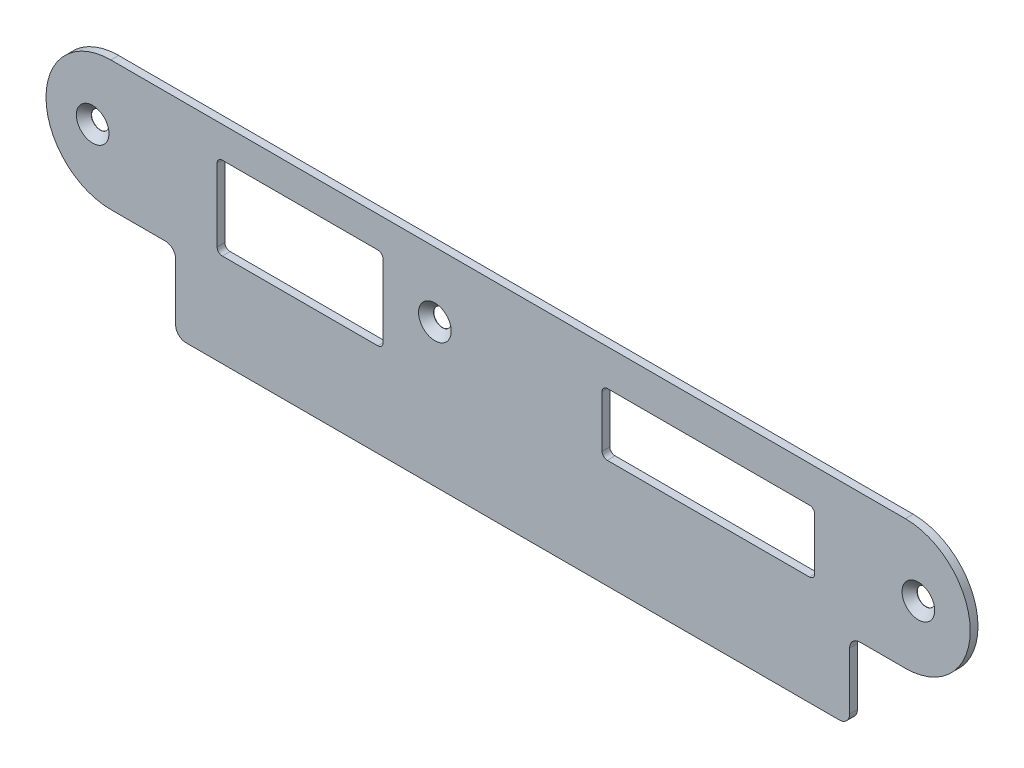
ISO-10303-21;
HEADER;
FILE_DESCRIPTION(('STEP AP214'),'2;1');
FILE_NAME('part.step','',(''),(''),'','','');
FILE_SCHEMA(('AUTOMOTIVE_DESIGN { 1 0 10303 214 1 1 1 1 }'));
ENDSEC;
DATA;
#1=APPLICATION_CONTEXT('core data for automotive mechanical design processes');
#2=APPLICATION_PROTOCOL_DEFINITION('international standard','automotive_design',2000,#1);
#3=PRODUCT_CONTEXT('',#1,'mechanical');
#4=PRODUCT('Part','Part','',(#3));
#5=PRODUCT_RELATED_PRODUCT_CATEGORY('part','',(#4));
#6=PRODUCT_DEFINITION_FORMATION('','',#4);
#7=PRODUCT_DEFINITION_CONTEXT('part definition',#1,'design');
#8=PRODUCT_DEFINITION('design','',#6,#7);
#9=PRODUCT_DEFINITION_SHAPE('','',#8);
#10=(LENGTH_UNIT() NAMED_UNIT(*) SI_UNIT(.MILLI.,.METRE.));
#11=(NAMED_UNIT(*) PLANE_ANGLE_UNIT() SI_UNIT($,.RADIAN.));
#12=(NAMED_UNIT(*) SI_UNIT($,.STERADIAN.) SOLID_ANGLE_UNIT());
#13=UNCERTAINTY_MEASURE_WITH_UNIT(LENGTH_MEASURE(1.E-05),#10,'distance_accuracy_value','');
#14=(GEOMETRIC_REPRESENTATION_CONTEXT(3) GLOBAL_UNCERTAINTY_ASSIGNED_CONTEXT((#13)) GLOBAL_UNIT_ASSIGNED_CONTEXT((#10,
#11,#12)) REPRESENTATION_CONTEXT('',''));
#15=CARTESIAN_POINT('',(0.,0.,0.));
#16=DIRECTION('',(0.,0.,1.));
#17=DIRECTION('',(1.,0.,0.));
#18=AXIS2_PLACEMENT_3D('',#15,#16,#17);
#19=CARTESIAN_POINT('',(-83.,6.50000000000004,1.5));
#20=DIRECTION('',(0.,0.,1.));
#21=DIRECTION('',(1.,0.,0.));
#22=AXIS2_PLACEMENT_3D('',#19,#20,#21);
#23=PLANE('',#22);
#24=CARTESIAN_POINT('',(-86.5,6.49999999999999,1.5));
#25=DIRECTION('',(0.,0.,1.));
#26=DIRECTION('',(1.,0.,0.));
#27=AXIS2_PLACEMENT_3D('',#24,#25,#26);
#28=CIRCLE('',#27,3.15);
#29=CARTESIAN_POINT('',(-83.35,6.49999999999999,1.5));
#30=VERTEX_POINT('',#29);
#31=EDGE_CURVE('E818',#30,#30,#28,.T.);
#32=ORIENTED_EDGE('',*,*,#31,.F.);
#33=EDGE_LOOP('',(#32));
#34=FACE_BOUND('',#33,.T.);
#35=CARTESIAN_POINT('',(-20.5,6.50000000000004,1.5));
#36=DIRECTION('',(0.,0.,1.));
#37=DIRECTION('',(1.,0.,0.));
#38=AXIS2_PLACEMENT_3D('',#35,#36,#37);
#39=CIRCLE('',#38,3.15);
#40=CARTESIAN_POINT('',(-17.35,6.50000000000004,1.5));
#41=VERTEX_POINT('',#40);
#42=EDGE_CURVE('E825',#41,#41,#39,.T.);
#43=ORIENTED_EDGE('',*,*,#42,.F.);
#44=EDGE_LOOP('',(#43));
#45=FACE_BOUND('',#44,.T.);
#46=CARTESIAN_POINT('',(72.75,6.50000000000006,1.5));
#47=DIRECTION('',(0.,0.,1.));
#48=DIRECTION('',(1.,0.,0.));
#49=AXIS2_PLACEMENT_3D('',#46,#47,#48);
#50=CIRCLE('',#49,3.15);
#51=CARTESIAN_POINT('',(75.9,6.50000000000006,1.5));
#52=VERTEX_POINT('',#51);
#53=EDGE_CURVE('E834',#52,#52,#50,.T.);
#54=ORIENTED_EDGE('',*,*,#53,.F.);
#55=EDGE_LOOP('',(#54));
#56=FACE_BOUND('',#55,.T.);
#57=DIRECTION('',(-1.,0.,0.));
#58=VECTOR('',#57,1.);
#59=CARTESIAN_POINT('',(51.75,12.0000000000001,1.5));
#60=LINE('',#59,#58);
#61=CARTESIAN_POINT('',(51.75,12.0000000000001,1.5));
#62=VERTEX_POINT('',#61);
#63=CARTESIAN_POINT('',(12.75,12.,1.5));
#64=VERTEX_POINT('',#63);
#65=EDGE_CURVE('E226',#62,#64,#60,.T.);
#66=ORIENTED_EDGE('',*,*,#65,.F.);
#67=CARTESIAN_POINT('',(51.75,11.,1.5));
#68=DIRECTION('',(0.,0.,1.));
#69=DIRECTION('',(1.,0.,0.));
#70=AXIS2_PLACEMENT_3D('',#67,#68,#69);
#71=CIRCLE('',#70,1.00000000000002);
#72=CARTESIAN_POINT('',(52.75,11.,1.5));
#73=VERTEX_POINT('',#72);
#74=EDGE_CURVE('E218',#73,#62,#71,.T.);
#75=ORIENTED_EDGE('',*,*,#74,.F.);
#76=DIRECTION('',(0.,1.,0.));
#77=VECTOR('',#76,1.);
#78=CARTESIAN_POINT('',(52.75,1.00000000000005,1.5));
#79=LINE('',#78,#77);
#80=CARTESIAN_POINT('',(52.75,1.00000000000005,1.5));
#81=VERTEX_POINT('',#80);
#82=EDGE_CURVE('E253',#81,#73,#79,.T.);
#83=ORIENTED_EDGE('',*,*,#82,.F.);
#84=CARTESIAN_POINT('',(51.75,1.00000000000004,1.5));
#85=DIRECTION('',(0.,0.,1.));
#86=DIRECTION('',(1.,0.,0.));
#87=AXIS2_PLACEMENT_3D('',#84,#85,#86);
#88=CIRCLE('',#87,0.999999999999997);
#89=CARTESIAN_POINT('',(51.75,0.,1.5));
#90=VERTEX_POINT('',#89);
#91=EDGE_CURVE('E251',#90,#81,#88,.T.);
#92=ORIENTED_EDGE('',*,*,#91,.F.);
#93=DIRECTION('',(1.,0.,0.));
#94=VECTOR('',#93,1.);
#95=CARTESIAN_POINT('',(12.75,0.,1.5));
#96=LINE('',#95,#94);
#97=CARTESIAN_POINT('',(12.75,0.,1.5));
#98=VERTEX_POINT('',#97);
#99=EDGE_CURVE('E249',#98,#90,#96,.T.);
#100=ORIENTED_EDGE('',*,*,#99,.F.);
#101=CARTESIAN_POINT('',(12.75,1.00000000000004,1.5));
#102=DIRECTION('',(0.,0.,1.));
#103=DIRECTION('',(1.,0.,0.));
#104=AXIS2_PLACEMENT_3D('',#101,#102,#103);
#105=CIRCLE('',#104,0.999999999999999);
#106=CARTESIAN_POINT('',(11.75,1.00000000000004,1.5));
#107=VERTEX_POINT('',#106);
#108=EDGE_CURVE('E247',#107,#98,#105,.T.);
#109=ORIENTED_EDGE('',*,*,#108,.F.);
#110=DIRECTION('',(0.,-1.,0.));
#111=VECTOR('',#110,1.);
#112=CARTESIAN_POINT('',(11.75,11.,1.5));
#113=LINE('',#112,#111);
#114=CARTESIAN_POINT('',(11.75,11.,1.5));
#115=VERTEX_POINT('',#114);
#116=EDGE_CURVE('E242',#115,#107,#113,.T.);
#117=ORIENTED_EDGE('',*,*,#116,.F.);
#118=CARTESIAN_POINT('',(12.75,11.,1.5));
#119=DIRECTION('',(0.,0.,1.));
#120=DIRECTION('',(1.,0.,0.));
#121=AXIS2_PLACEMENT_3D('',#118,#119,#120);
#122=CIRCLE('',#121,1.);
#123=EDGE_CURVE('E240',#64,#115,#122,.T.);
#124=ORIENTED_EDGE('',*,*,#123,.F.);
#125=EDGE_LOOP('',(#66,#75,#83,#92,#100,#109,#117,#124));
#126=FACE_BOUND('',#125,.T.);
#127=DIRECTION('',(0.,-1.,0.));
#128=VECTOR('',#127,1.);
#129=CARTESIAN_POINT('',(-62.5,12.,1.5));
#130=LINE('',#129,#128);
#131=CARTESIAN_POINT('',(-62.5,12.,1.5));
#132=VERTEX_POINT('',#131);
#133=CARTESIAN_POINT('',(-62.5,-2.00000000000002,1.5));
#134=VERTEX_POINT('',#133);
#135=EDGE_CURVE('E288',#132,#134,#130,.T.);
#136=ORIENTED_EDGE('',*,*,#135,.F.);
#137=CARTESIAN_POINT('',(-61.5,12.,1.5));
#138=DIRECTION('',(0.,0.,1.));
#139=DIRECTION('',(1.,0.,0.));
#140=AXIS2_PLACEMENT_3D('',#137,#138,#139);
#141=CIRCLE('',#140,1.);
#142=CARTESIAN_POINT('',(-61.5,13.,1.5));
#143=VERTEX_POINT('',#142);
#144=EDGE_CURVE('E286',#143,#132,#141,.T.);
#145=ORIENTED_EDGE('',*,*,#144,.F.);
#146=DIRECTION('',(-1.,0.,0.));
#147=VECTOR('',#146,1.);
#148=CARTESIAN_POINT('',(-31.5,13.,1.5));
#149=LINE('',#148,#147);
#150=CARTESIAN_POINT('',(-31.5,13.,1.5));
#151=VERTEX_POINT('',#150);
#152=EDGE_CURVE('E302',#151,#143,#149,.T.);
#153=ORIENTED_EDGE('',*,*,#152,.F.);
#154=CARTESIAN_POINT('',(-31.5,12.,1.5));
#155=DIRECTION('',(0.,0.,1.));
#156=DIRECTION('',(1.,0.,0.));
#157=AXIS2_PLACEMENT_3D('',#154,#155,#156);
#158=CIRCLE('',#157,0.999999999999991);
#159=CARTESIAN_POINT('',(-30.5,12.,1.5));
#160=VERTEX_POINT('',#159);
#161=EDGE_CURVE('E299',#160,#151,#158,.T.);
#162=ORIENTED_EDGE('',*,*,#161,.F.);
#163=DIRECTION('',(0.,1.,0.));
#164=VECTOR('',#163,1.);
#165=CARTESIAN_POINT('',(-30.5,-2.00000000000002,1.5));
#166=LINE('',#165,#164);
#167=CARTESIAN_POINT('',(-30.5,-2.00000000000002,1.5));
#168=VERTEX_POINT('',#167);
#169=EDGE_CURVE('E297',#168,#160,#166,.T.);
#170=ORIENTED_EDGE('',*,*,#169,.F.);
#171=CARTESIAN_POINT('',(-31.5,-2.00000000000002,1.5));
#172=DIRECTION('',(0.,0.,1.));
#173=DIRECTION('',(1.,0.,0.));
#174=AXIS2_PLACEMENT_3D('',#171,#172,#173);
#175=CIRCLE('',#174,1.);
#176=CARTESIAN_POINT('',(-31.5,-3.00000000000002,1.5));
#177=VERTEX_POINT('',#176);
#178=EDGE_CURVE('E295',#177,#168,#175,.T.);
#179=ORIENTED_EDGE('',*,*,#178,.F.);
#180=DIRECTION('',(1.,0.,0.));
#181=VECTOR('',#180,1.);
#182=CARTESIAN_POINT('',(-61.5,-3.00000000000003,1.5));
#183=LINE('',#182,#181);
#184=CARTESIAN_POINT('',(-61.5,-3.00000000000003,1.5));
#185=VERTEX_POINT('',#184);
#186=EDGE_CURVE('E293',#185,#177,#183,.T.);
#187=ORIENTED_EDGE('',*,*,#186,.F.);
#188=CARTESIAN_POINT('',(-61.5,-2.00000000000003,1.5));
#189=DIRECTION('',(0.,0.,1.));
#190=DIRECTION('',(1.,0.,0.));
#191=AXIS2_PLACEMENT_3D('',#188,#189,#190);
#192=CIRCLE('',#191,1.);
#193=EDGE_CURVE('E291',#134,#185,#192,.T.);
#194=ORIENTED_EDGE('',*,*,#193,.F.);
#195=EDGE_LOOP('',(#136,#145,#153,#162,#170,#179,#187,#194));
#196=FACE_BOUND('',#195,.T.);
#197=CARTESIAN_POINT('',(-83.,6.50000000000004,1.5));
#198=DIRECTION('',(0.,0.,1.));
#199=DIRECTION('',(1.,0.,0.));
#200=AXIS2_PLACEMENT_3D('',#197,#198,#199);
#201=CIRCLE('',#200,12.5);
#202=CARTESIAN_POINT('',(-83.,19.,1.5));
#203=VERTEX_POINT('',#202);
#204=CARTESIAN_POINT('',(-83.,-5.99999999999994,1.5));
#205=VERTEX_POINT('',#204);
#206=EDGE_CURVE('E345',#203,#205,#201,.T.);
#207=ORIENTED_EDGE('',*,*,#206,.T.);
#208=DIRECTION('',(1.,0.,0.));
#209=VECTOR('',#208,1.);
#210=CARTESIAN_POINT('',(-83.,-5.99999999999994,1.5));
#211=LINE('',#210,#209);
#212=CARTESIAN_POINT('',(-72.5,-6.00000000000005,1.5));
#213=VERTEX_POINT('',#212);
#214=EDGE_CURVE('E348',#205,#213,#211,.T.);
#215=ORIENTED_EDGE('',*,*,#214,.T.);
#216=CARTESIAN_POINT('',(-72.5,-8.00000000000005,1.5));
#217=DIRECTION('',(0.,0.,-1.));
#218=DIRECTION('',(1.,0.,0.));
#219=AXIS2_PLACEMENT_3D('',#216,#217,#218);
#220=CIRCLE('',#219,2.);
#221=CARTESIAN_POINT('',(-70.5,-8.00000000000005,1.5));
#222=VERTEX_POINT('',#221);
#223=EDGE_CURVE('E351',#213,#222,#220,.T.);
#224=ORIENTED_EDGE('',*,*,#223,.T.);
#225=DIRECTION('',(0.,-1.,0.));
#226=VECTOR('',#225,1.);
#227=CARTESIAN_POINT('',(-70.5,-8.00000000000005,1.5));
#228=LINE('',#227,#226);
#229=CARTESIAN_POINT('',(-70.5,-19.,1.5));
#230=VERTEX_POINT('',#229);
#231=EDGE_CURVE('E353',#222,#230,#228,.T.);
#232=ORIENTED_EDGE('',*,*,#231,.T.);
#233=CARTESIAN_POINT('',(-68.5,-19.,1.5));
#234=DIRECTION('',(0.,0.,1.));
#235=DIRECTION('',(1.,0.,0.));
#236=AXIS2_PLACEMENT_3D('',#233,#234,#235);
#237=CIRCLE('',#236,2.00000000000001);
#238=CARTESIAN_POINT('',(-68.5,-21.,1.5));
#239=VERTEX_POINT('',#238);
#240=EDGE_CURVE('E355',#230,#239,#237,.T.);
#241=ORIENTED_EDGE('',*,*,#240,.T.);
#242=DIRECTION('',(1.,0.,0.));
#243=VECTOR('',#242,1.);
#244=CARTESIAN_POINT('',(-68.5,-21.,1.5));
#245=LINE('',#244,#243);
#246=CARTESIAN_POINT('',(57.5,-20.9999999999999,1.5));
#247=VERTEX_POINT('',#246);
#248=EDGE_CURVE('E357',#239,#247,#245,.T.);
#249=ORIENTED_EDGE('',*,*,#248,.T.);
#250=CARTESIAN_POINT('',(57.5,-18.9999999999999,1.5));
#251=DIRECTION('',(0.,0.,1.));
#252=DIRECTION('',(1.,0.,0.));
#253=AXIS2_PLACEMENT_3D('',#250,#251,#252);
#254=CIRCLE('',#253,1.99999999999999);
#255=CARTESIAN_POINT('',(59.5,-18.9999999999999,1.5));
#256=VERTEX_POINT('',#255);
#257=EDGE_CURVE('E359',#247,#256,#254,.T.);
#258=ORIENTED_EDGE('',*,*,#257,.T.);
#259=DIRECTION('',(0.,1.,0.));
#260=VECTOR('',#259,1.);
#261=CARTESIAN_POINT('',(59.5,-18.9999999999999,1.5));
#262=LINE('',#261,#260);
#263=CARTESIAN_POINT('',(59.5,-7.99999999999995,1.5));
#264=VERTEX_POINT('',#263);
#265=EDGE_CURVE('E361',#256,#264,#262,.T.);
#266=ORIENTED_EDGE('',*,*,#265,.T.);
#267=CARTESIAN_POINT('',(61.5,-7.99999999999995,1.5));
#268=DIRECTION('',(0.,0.,-1.));
#269=DIRECTION('',(1.,0.,0.));
#270=AXIS2_PLACEMENT_3D('',#267,#268,#269);
#271=CIRCLE('',#270,2.);
#272=CARTESIAN_POINT('',(61.5,-5.99999999999995,1.5));
#273=VERTEX_POINT('',#272);
#274=EDGE_CURVE('E363',#264,#273,#271,.T.);
#275=ORIENTED_EDGE('',*,*,#274,.T.);
#276=DIRECTION('',(1.,0.,0.));
#277=VECTOR('',#276,1.);
#278=CARTESIAN_POINT('',(61.5,-5.99999999999995,1.5));
#279=LINE('',#278,#277);
#280=CARTESIAN_POINT('',(70.25,-5.99999999999994,1.5));
#281=VERTEX_POINT('',#280);
#282=EDGE_CURVE('E365',#273,#281,#279,.T.);
#283=ORIENTED_EDGE('',*,*,#282,.T.);
#284=CARTESIAN_POINT('',(70.25,6.50000000000006,1.5));
#285=DIRECTION('',(0.,0.,1.));
#286=DIRECTION('',(1.,0.,0.));
#287=AXIS2_PLACEMENT_3D('',#284,#285,#286);
#288=CIRCLE('',#287,12.5);
#289=CARTESIAN_POINT('',(70.25,19.0000000000001,1.5));
#290=VERTEX_POINT('',#289);
#291=EDGE_CURVE('E367',#281,#290,#288,.T.);
#292=ORIENTED_EDGE('',*,*,#291,.T.);
#293=DIRECTION('',(-1.,0.,0.));
#294=VECTOR('',#293,1.);
#295=CARTESIAN_POINT('',(70.25,19.0000000000001,1.5));
#296=LINE('',#295,#294);
#297=EDGE_CURVE('E369',#290,#203,#296,.T.);
#298=ORIENTED_EDGE('',*,*,#297,.T.);
#299=EDGE_LOOP('',(#207,#215,#224,#232,#241,#249,#258,#266,#275,#283,#292,#298));
#300=FACE_BOUND('',#299,.T.);
#301=ADVANCED_FACE('F33',(#34,#45,#56,#126,#196,#300),#23,.T.);
#302=CARTESIAN_POINT('',(-83.,6.50000000000004,0.));
#303=DIRECTION('',(0.,0.,1.));
#304=DIRECTION('',(1.,0.,0.));
#305=AXIS2_PLACEMENT_3D('',#302,#303,#304);
#306=PLANE('',#305);
#307=CARTESIAN_POINT('',(-86.5,6.49999999999999,0.));
#308=DIRECTION('',(0.,0.,1.));
#309=DIRECTION('',(1.,0.,0.));
#310=AXIS2_PLACEMENT_3D('',#307,#308,#309);
#311=CIRCLE('',#310,1.69999999999999);
#312=CARTESIAN_POINT('',(-84.8,6.49999999999999,0.));
#313=VERTEX_POINT('',#312);
#314=EDGE_CURVE('E820',#313,#313,#311,.T.);
#315=ORIENTED_EDGE('',*,*,#314,.T.);
#316=EDGE_LOOP('',(#315));
#317=FACE_BOUND('',#316,.T.);
#318=CARTESIAN_POINT('',(-20.5,6.50000000000004,0.));
#319=DIRECTION('',(0.,0.,1.));
#320=DIRECTION('',(1.,0.,0.));
#321=AXIS2_PLACEMENT_3D('',#318,#319,#320);
#322=CIRCLE('',#321,1.7);
#323=CARTESIAN_POINT('',(-18.8,6.50000000000004,0.));
#324=VERTEX_POINT('',#323);
#325=EDGE_CURVE('E831',#324,#324,#322,.T.);
#326=ORIENTED_EDGE('',*,*,#325,.T.);
#327=EDGE_LOOP('',(#326));
#328=FACE_BOUND('',#327,.T.);
#329=CARTESIAN_POINT('',(72.75,6.50000000000006,0.));
#330=DIRECTION('',(0.,0.,1.));
#331=DIRECTION('',(1.,0.,0.));
#332=AXIS2_PLACEMENT_3D('',#329,#330,#331);
#333=CIRCLE('',#332,1.69999999999999);
#334=CARTESIAN_POINT('',(74.45,6.50000000000006,0.));
#335=VERTEX_POINT('',#334);
#336=EDGE_CURVE('E256',#335,#335,#333,.T.);
#337=ORIENTED_EDGE('',*,*,#336,.T.);
#338=EDGE_LOOP('',(#337));
#339=FACE_BOUND('',#338,.T.);
#340=CARTESIAN_POINT('',(51.75,11.,0.));
#341=DIRECTION('',(0.,0.,1.));
#342=DIRECTION('',(1.,0.,0.));
#343=AXIS2_PLACEMENT_3D('',#340,#341,#342);
#344=CIRCLE('',#343,1.00000000000002);
#345=CARTESIAN_POINT('',(52.75,11.,0.));
#346=VERTEX_POINT('',#345);
#347=CARTESIAN_POINT('',(51.75,12.0000000000001,0.));
#348=VERTEX_POINT('',#347);
#349=EDGE_CURVE('E56',#346,#348,#344,.T.);
#350=ORIENTED_EDGE('',*,*,#349,.T.);
#351=DIRECTION('',(-1.,0.,0.));
#352=VECTOR('',#351,1.);
#353=CARTESIAN_POINT('',(51.75,12.0000000000001,0.));
#354=LINE('',#353,#352);
#355=CARTESIAN_POINT('',(12.75,12.,0.));
#356=VERTEX_POINT('',#355);
#357=EDGE_CURVE('E233',#348,#356,#354,.T.);
#358=ORIENTED_EDGE('',*,*,#357,.T.);
#359=CARTESIAN_POINT('',(12.75,11.,0.));
#360=DIRECTION('',(0.,0.,1.));
#361=DIRECTION('',(1.,0.,0.));
#362=AXIS2_PLACEMENT_3D('',#359,#360,#361);
#363=CIRCLE('',#362,1.);
#364=CARTESIAN_POINT('',(11.75,11.,0.));
#365=VERTEX_POINT('',#364);
#366=EDGE_CURVE('E258',#356,#365,#363,.T.);
#367=ORIENTED_EDGE('',*,*,#366,.T.);
#368=DIRECTION('',(0.,-1.,0.));
#369=VECTOR('',#368,1.);
#370=CARTESIAN_POINT('',(11.75,11.,0.));
#371=LINE('',#370,#369);
#372=CARTESIAN_POINT('',(11.75,1.00000000000004,0.));
#373=VERTEX_POINT('',#372);
#374=EDGE_CURVE('E261',#365,#373,#371,.T.);
#375=ORIENTED_EDGE('',*,*,#374,.T.);
#376=CARTESIAN_POINT('',(12.75,1.00000000000004,0.));
#377=DIRECTION('',(0.,0.,1.));
#378=DIRECTION('',(1.,0.,0.));
#379=AXIS2_PLACEMENT_3D('',#376,#377,#378);
#380=CIRCLE('',#379,0.999999999999999);
#381=CARTESIAN_POINT('',(12.75,0.,0.));
#382=VERTEX_POINT('',#381);
#383=EDGE_CURVE('E264',#373,#382,#380,.T.);
#384=ORIENTED_EDGE('',*,*,#383,.T.);
#385=DIRECTION('',(1.,0.,0.));
#386=VECTOR('',#385,1.);
#387=CARTESIAN_POINT('',(12.75,0.,0.));
#388=LINE('',#387,#386);
#389=CARTESIAN_POINT('',(51.75,0.,0.));
#390=VERTEX_POINT('',#389);
#391=EDGE_CURVE('E267',#382,#390,#388,.T.);
#392=ORIENTED_EDGE('',*,*,#391,.T.);
#393=CARTESIAN_POINT('',(51.75,1.00000000000004,0.));
#394=DIRECTION('',(0.,0.,1.));
#395=DIRECTION('',(1.,0.,0.));
#396=AXIS2_PLACEMENT_3D('',#393,#394,#395);
#397=CIRCLE('',#396,0.999999999999997);
#398=CARTESIAN_POINT('',(52.75,1.00000000000005,0.));
#399=VERTEX_POINT('',#398);
#400=EDGE_CURVE('E270',#390,#399,#397,.T.);
#401=ORIENTED_EDGE('',*,*,#400,.T.);
#402=DIRECTION('',(0.,1.,0.));
#403=VECTOR('',#402,1.);
#404=CARTESIAN_POINT('',(52.75,1.00000000000005,0.));
#405=LINE('',#404,#403);
#406=EDGE_CURVE('E227',#399,#346,#405,.T.);
#407=ORIENTED_EDGE('',*,*,#406,.T.);
#408=EDGE_LOOP('',(#350,#358,#367,#375,#384,#392,#401,#407));
#409=FACE_BOUND('',#408,.T.);
#410=CARTESIAN_POINT('',(-61.5,12.,0.));
#411=DIRECTION('',(0.,0.,1.));
#412=DIRECTION('',(1.,0.,0.));
#413=AXIS2_PLACEMENT_3D('',#410,#411,#412);
#414=CIRCLE('',#413,1.);
#415=CARTESIAN_POINT('',(-61.5,13.,0.));
#416=VERTEX_POINT('',#415);
#417=CARTESIAN_POINT('',(-62.5,12.,0.));
#418=VERTEX_POINT('',#417);
#419=EDGE_CURVE('E234',#416,#418,#414,.T.);
#420=ORIENTED_EDGE('',*,*,#419,.T.);
#421=DIRECTION('',(0.,-1.,0.));
#422=VECTOR('',#421,1.);
#423=CARTESIAN_POINT('',(-62.5,12.,0.));
#424=LINE('',#423,#422);
#425=CARTESIAN_POINT('',(-62.5,-2.00000000000002,0.));
#426=VERTEX_POINT('',#425);
#427=EDGE_CURVE('E307',#418,#426,#424,.T.);
#428=ORIENTED_EDGE('',*,*,#427,.T.);
#429=CARTESIAN_POINT('',(-61.5,-2.00000000000003,0.));
#430=DIRECTION('',(0.,0.,1.));
#431=DIRECTION('',(1.,0.,0.));
#432=AXIS2_PLACEMENT_3D('',#429,#430,#431);
#433=CIRCLE('',#432,1.);
#434=CARTESIAN_POINT('',(-61.5,-3.00000000000003,0.));
#435=VERTEX_POINT('',#434);
#436=EDGE_CURVE('E310',#426,#435,#433,.T.);
#437=ORIENTED_EDGE('',*,*,#436,.T.);
#438=DIRECTION('',(1.,0.,0.));
#439=VECTOR('',#438,1.);
#440=CARTESIAN_POINT('',(-61.5,-3.00000000000003,0.));
#441=LINE('',#440,#439);
#442=CARTESIAN_POINT('',(-31.5,-3.00000000000002,0.));
#443=VERTEX_POINT('',#442);
#444=EDGE_CURVE('E313',#435,#443,#441,.T.);
#445=ORIENTED_EDGE('',*,*,#444,.T.);
#446=CARTESIAN_POINT('',(-31.5,-2.00000000000002,0.));
#447=DIRECTION('',(0.,0.,1.));
#448=DIRECTION('',(1.,0.,0.));
#449=AXIS2_PLACEMENT_3D('',#446,#447,#448);
#450=CIRCLE('',#449,1.);
#451=CARTESIAN_POINT('',(-30.5,-2.00000000000002,0.));
#452=VERTEX_POINT('',#451);
#453=EDGE_CURVE('E316',#443,#452,#450,.T.);
#454=ORIENTED_EDGE('',*,*,#453,.T.);
#455=DIRECTION('',(0.,1.,0.));
#456=VECTOR('',#455,1.);
#457=CARTESIAN_POINT('',(-30.5,-2.00000000000002,0.));
#458=LINE('',#457,#456);
#459=CARTESIAN_POINT('',(-30.5,12.,0.));
#460=VERTEX_POINT('',#459);
#461=EDGE_CURVE('E319',#452,#460,#458,.T.);
#462=ORIENTED_EDGE('',*,*,#461,.T.);
#463=CARTESIAN_POINT('',(-31.5,12.,0.));
#464=DIRECTION('',(0.,0.,1.));
#465=DIRECTION('',(1.,0.,0.));
#466=AXIS2_PLACEMENT_3D('',#463,#464,#465);
#467=CIRCLE('',#466,0.999999999999991);
#468=CARTESIAN_POINT('',(-31.5,13.,0.));
#469=VERTEX_POINT('',#468);
#470=EDGE_CURVE('E322',#460,#469,#467,.T.);
#471=ORIENTED_EDGE('',*,*,#470,.T.);
#472=DIRECTION('',(-1.,0.,0.));
#473=VECTOR('',#472,1.);
#474=CARTESIAN_POINT('',(-31.5,13.,0.));
#475=LINE('',#474,#473);
#476=EDGE_CURVE('E289',#469,#416,#475,.T.);
#477=ORIENTED_EDGE('',*,*,#476,.T.);
#478=EDGE_LOOP('',(#420,#428,#437,#445,#454,#462,#471,#477));
#479=FACE_BOUND('',#478,.T.);
#480=CARTESIAN_POINT('',(-83.,6.50000000000004,0.));
#481=DIRECTION('',(0.,0.,1.));
#482=DIRECTION('',(1.,0.,0.));
#483=AXIS2_PLACEMENT_3D('',#480,#481,#482);
#484=CIRCLE('',#483,12.5);
#485=CARTESIAN_POINT('',(-83.,19.,0.));
#486=VERTEX_POINT('',#485);
#487=CARTESIAN_POINT('',(-83.,-5.99999999999994,0.));
#488=VERTEX_POINT('',#487);
#489=EDGE_CURVE('E344',#486,#488,#484,.T.);
#490=ORIENTED_EDGE('',*,*,#489,.F.);
#491=DIRECTION('',(-1.,0.,0.));
#492=VECTOR('',#491,1.);
#493=CARTESIAN_POINT('',(70.25,19.0000000000001,0.));
#494=LINE('',#493,#492);
#495=CARTESIAN_POINT('',(70.25,19.0000000000001,0.));
#496=VERTEX_POINT('',#495);
#497=EDGE_CURVE('E349',#496,#486,#494,.T.);
#498=ORIENTED_EDGE('',*,*,#497,.F.);
#499=CARTESIAN_POINT('',(70.25,6.50000000000006,0.));
#500=DIRECTION('',(0.,0.,1.));
#501=DIRECTION('',(1.,0.,0.));
#502=AXIS2_PLACEMENT_3D('',#499,#500,#501);
#503=CIRCLE('',#502,12.5);
#504=CARTESIAN_POINT('',(70.25,-5.99999999999994,0.));
#505=VERTEX_POINT('',#504);
#506=EDGE_CURVE('E392',#505,#496,#503,.T.);
#507=ORIENTED_EDGE('',*,*,#506,.F.);
#508=DIRECTION('',(1.,0.,0.));
#509=VECTOR('',#508,1.);
#510=CARTESIAN_POINT('',(61.5,-5.99999999999995,0.));
#511=LINE('',#510,#509);
#512=CARTESIAN_POINT('',(61.5,-5.99999999999995,0.));
#513=VERTEX_POINT('',#512);
#514=EDGE_CURVE('E390',#513,#505,#511,.T.);
#515=ORIENTED_EDGE('',*,*,#514,.F.);
#516=CARTESIAN_POINT('',(61.5,-7.99999999999995,0.));
#517=DIRECTION('',(0.,0.,-1.));
#518=DIRECTION('',(1.,0.,0.));
#519=AXIS2_PLACEMENT_3D('',#516,#517,#518);
#520=CIRCLE('',#519,2.);
#521=CARTESIAN_POINT('',(59.5,-7.99999999999995,0.));
#522=VERTEX_POINT('',#521);
#523=EDGE_CURVE('E388',#522,#513,#520,.T.);
#524=ORIENTED_EDGE('',*,*,#523,.F.);
#525=DIRECTION('',(0.,1.,0.));
#526=VECTOR('',#525,1.);
#527=CARTESIAN_POINT('',(59.5,-18.9999999999999,0.));
#528=LINE('',#527,#526);
#529=CARTESIAN_POINT('',(59.5,-18.9999999999999,0.));
#530=VERTEX_POINT('',#529);
#531=EDGE_CURVE('E386',#530,#522,#528,.T.);
#532=ORIENTED_EDGE('',*,*,#531,.F.);
#533=CARTESIAN_POINT('',(57.5,-18.9999999999999,0.));
#534=DIRECTION('',(0.,0.,1.));
#535=DIRECTION('',(1.,0.,0.));
#536=AXIS2_PLACEMENT_3D('',#533,#534,#535);
#537=CIRCLE('',#536,1.99999999999999);
#538=CARTESIAN_POINT('',(57.5,-20.9999999999999,0.));
#539=VERTEX_POINT('',#538);
#540=EDGE_CURVE('E384',#539,#530,#537,.T.);
#541=ORIENTED_EDGE('',*,*,#540,.F.);
#542=DIRECTION('',(1.,0.,0.));
#543=VECTOR('',#542,1.);
#544=CARTESIAN_POINT('',(-68.5,-21.,0.));
#545=LINE('',#544,#543);
#546=CARTESIAN_POINT('',(-68.5,-21.,0.));
#547=VERTEX_POINT('',#546);
#548=EDGE_CURVE('E382',#547,#539,#545,.T.);
#549=ORIENTED_EDGE('',*,*,#548,.F.);
#550=CARTESIAN_POINT('',(-68.5,-19.,0.));
#551=DIRECTION('',(0.,0.,1.));
#552=DIRECTION('',(1.,0.,0.));
#553=AXIS2_PLACEMENT_3D('',#550,#551,#552);
#554=CIRCLE('',#553,2.00000000000001);
#555=CARTESIAN_POINT('',(-70.5,-19.,0.));
#556=VERTEX_POINT('',#555);
#557=EDGE_CURVE('E380',#556,#547,#554,.T.);
#558=ORIENTED_EDGE('',*,*,#557,.F.);
#559=DIRECTION('',(0.,-1.,0.));
#560=VECTOR('',#559,1.);
#561=CARTESIAN_POINT('',(-70.5,-8.00000000000005,0.));
#562=LINE('',#561,#560);
#563=CARTESIAN_POINT('',(-70.5,-8.00000000000005,0.));
#564=VERTEX_POINT('',#563);
#565=EDGE_CURVE('E378',#564,#556,#562,.T.);
#566=ORIENTED_EDGE('',*,*,#565,.F.);
#567=CARTESIAN_POINT('',(-72.5,-8.00000000000005,0.));
#568=DIRECTION('',(0.,0.,-1.));
#569=DIRECTION('',(1.,0.,0.));
#570=AXIS2_PLACEMENT_3D('',#567,#568,#569);
#571=CIRCLE('',#570,2.);
#572=CARTESIAN_POINT('',(-72.5,-6.00000000000005,0.));
#573=VERTEX_POINT('',#572);
#574=EDGE_CURVE('E376',#573,#564,#571,.T.);
#575=ORIENTED_EDGE('',*,*,#574,.F.);
#576=DIRECTION('',(1.,0.,0.));
#577=VECTOR('',#576,1.);
#578=CARTESIAN_POINT('',(-83.,-5.99999999999994,0.));
#579=LINE('',#578,#577);
#580=EDGE_CURVE('E374',#488,#573,#579,.T.);
#581=ORIENTED_EDGE('',*,*,#580,.F.);
#582=EDGE_LOOP('',(#490,#498,#507,#515,#524,#532,#541,#549,#558,#566,#575,#581));
#583=FACE_BOUND('',#582,.T.);
#584=ADVANCED_FACE('F434',(#317,#328,#339,#409,#479,#583),#306,.F.);
#585=CARTESIAN_POINT('',(-83.,6.50000000000004,1.5));
#586=DIRECTION('',(0.,0.,-1.));
#587=DIRECTION('',(-1.,0.,0.));
#588=AXIS2_PLACEMENT_3D('',#585,#586,#587);
#589=CYLINDRICAL_SURFACE('',#588,12.5);
#590=ORIENTED_EDGE('',*,*,#489,.T.);
#591=DIRECTION('',(0.,0.,-1.));
#592=VECTOR('',#591,1.);
#593=CARTESIAN_POINT('',(-83.,-5.99999999999994,1.5));
#594=LINE('',#593,#592);
#595=EDGE_CURVE('E11',#205,#488,#594,.T.);
#596=ORIENTED_EDGE('',*,*,#595,.F.);
#597=ORIENTED_EDGE('',*,*,#206,.F.);
#598=DIRECTION('',(0.,0.,-1.));
#599=VECTOR('',#598,1.);
#600=CARTESIAN_POINT('',(-83.,19.,1.5));
#601=LINE('',#600,#599);
#602=EDGE_CURVE('E371',#203,#486,#601,.T.);
#603=ORIENTED_EDGE('',*,*,#602,.T.);
#604=EDGE_LOOP('',(#590,#596,#597,#603));
#605=FACE_BOUND('',#604,.T.);
#606=ADVANCED_FACE('F35',(#605),#589,.T.);
#607=CARTESIAN_POINT('',(-83.,-5.99999999999994,1.5));
#608=DIRECTION('',(0.,1.,0.));
#609=DIRECTION('',(-1.,0.,0.));
#610=AXIS2_PLACEMENT_3D('',#607,#608,#609);
#611=PLANE('',#610);
#612=ORIENTED_EDGE('',*,*,#580,.T.);
#613=DIRECTION('',(0.,0.,-1.));
#614=VECTOR('',#613,1.);
#615=CARTESIAN_POINT('',(-72.5,-6.00000000000005,1.5));
#616=LINE('',#615,#614);
#617=EDGE_CURVE('E41',#213,#573,#616,.T.);
#618=ORIENTED_EDGE('',*,*,#617,.F.);
#619=ORIENTED_EDGE('',*,*,#214,.F.);
#620=ORIENTED_EDGE('',*,*,#595,.T.);
#621=EDGE_LOOP('',(#612,#618,#619,#620));
#622=FACE_BOUND('',#621,.T.);
#623=ADVANCED_FACE('F450',(#622),#611,.F.);
#624=CARTESIAN_POINT('',(-72.5,-8.00000000000005,1.5));
#625=DIRECTION('',(0.,0.,-1.));
#626=DIRECTION('',(-1.,0.,0.));
#627=AXIS2_PLACEMENT_3D('',#624,#625,#626);
#628=CYLINDRICAL_SURFACE('',#627,2.);
#629=ORIENTED_EDGE('',*,*,#574,.T.);
#630=DIRECTION('',(0.,0.,-1.));
#631=VECTOR('',#630,1.);
#632=CARTESIAN_POINT('',(-70.5,-8.00000000000005,1.5));
#633=LINE('',#632,#631);
#634=EDGE_CURVE('E421',#222,#564,#633,.T.);
#635=ORIENTED_EDGE('',*,*,#634,.F.);
#636=ORIENTED_EDGE('',*,*,#223,.F.);
#637=ORIENTED_EDGE('',*,*,#617,.T.);
#638=EDGE_LOOP('',(#629,#635,#636,#637));
#639=FACE_BOUND('',#638,.T.);
#640=ADVANCED_FACE('F428',(#639),#628,.F.);
#641=CARTESIAN_POINT('',(-70.5,-8.00000000000005,1.5));
#642=DIRECTION('',(1.,0.,0.));
#643=DIRECTION('',(0.,0.,-1.));
#644=AXIS2_PLACEMENT_3D('',#641,#642,#643);
#645=PLANE('',#644);
#646=ORIENTED_EDGE('',*,*,#565,.T.);
#647=DIRECTION('',(0.,0.,-1.));
#648=VECTOR('',#647,1.);
#649=CARTESIAN_POINT('',(-70.5,-19.,1.5));
#650=LINE('',#649,#648);
#651=EDGE_CURVE('E418',#230,#556,#650,.T.);
#652=ORIENTED_EDGE('',*,*,#651,.F.);
#653=ORIENTED_EDGE('',*,*,#231,.F.);
#654=ORIENTED_EDGE('',*,*,#634,.T.);
#655=EDGE_LOOP('',(#646,#652,#653,#654));
#656=FACE_BOUND('',#655,.T.);
#657=ADVANCED_FACE('F439',(#656),#645,.F.);
#658=CARTESIAN_POINT('',(-68.5,-19.,1.5));
#659=DIRECTION('',(0.,0.,-1.));
#660=DIRECTION('',(-1.,0.,0.));
#661=AXIS2_PLACEMENT_3D('',#658,#659,#660);
#662=CYLINDRICAL_SURFACE('',#661,2.00000000000001);
#663=ORIENTED_EDGE('',*,*,#557,.T.);
#664=DIRECTION('',(0.,0.,-1.));
#665=VECTOR('',#664,1.);
#666=CARTESIAN_POINT('',(-68.5,-21.,1.5));
#667=LINE('',#666,#665);
#668=EDGE_CURVE('E415',#239,#547,#667,.T.);
#669=ORIENTED_EDGE('',*,*,#668,.F.);
#670=ORIENTED_EDGE('',*,*,#240,.F.);
#671=ORIENTED_EDGE('',*,*,#651,.T.);
#672=EDGE_LOOP('',(#663,#669,#670,#671));
#673=FACE_BOUND('',#672,.T.);
#674=ADVANCED_FACE('F443',(#673),#662,.T.);
#675=CARTESIAN_POINT('',(-68.5,-21.,1.5));
#676=DIRECTION('',(0.,1.,0.));
#677=DIRECTION('',(-1.,0.,0.));
#678=AXIS2_PLACEMENT_3D('',#675,#676,#677);
#679=PLANE('',#678);
#680=ORIENTED_EDGE('',*,*,#548,.T.);
#681=DIRECTION('',(0.,0.,-1.));
#682=VECTOR('',#681,1.);
#683=CARTESIAN_POINT('',(57.5,-20.9999999999999,1.5));
#684=LINE('',#683,#682);
#685=EDGE_CURVE('E412',#247,#539,#684,.T.);
#686=ORIENTED_EDGE('',*,*,#685,.F.);
#687=ORIENTED_EDGE('',*,*,#248,.F.);
#688=ORIENTED_EDGE('',*,*,#668,.T.);
#689=EDGE_LOOP('',(#680,#686,#687,#688));
#690=FACE_BOUND('',#689,.T.);
#691=ADVANCED_FACE('F483',(#690),#679,.F.);
#692=CARTESIAN_POINT('',(57.5,-18.9999999999999,1.5));
#693=DIRECTION('',(0.,0.,-1.));
#694=DIRECTION('',(-1.,0.,0.));
#695=AXIS2_PLACEMENT_3D('',#692,#693,#694);
#696=CYLINDRICAL_SURFACE('',#695,1.99999999999999);
#697=ORIENTED_EDGE('',*,*,#540,.T.);
#698=DIRECTION('',(0.,0.,-1.));
#699=VECTOR('',#698,1.);
#700=CARTESIAN_POINT('',(59.5,-18.9999999999999,1.5));
#701=LINE('',#700,#699);
#702=EDGE_CURVE('E409',#256,#530,#701,.T.);
#703=ORIENTED_EDGE('',*,*,#702,.F.);
#704=ORIENTED_EDGE('',*,*,#257,.F.);
#705=ORIENTED_EDGE('',*,*,#685,.T.);
#706=EDGE_LOOP('',(#697,#703,#704,#705));
#707=FACE_BOUND('',#706,.T.);
#708=ADVANCED_FACE('F481',(#707),#696,.T.);
#709=CARTESIAN_POINT('',(59.5,-18.9999999999999,1.5));
#710=DIRECTION('',(-1.,0.,0.));
#711=DIRECTION('',(0.,-1.,0.));
#712=AXIS2_PLACEMENT_3D('',#709,#710,#711);
#713=PLANE('',#712);
#714=ORIENTED_EDGE('',*,*,#531,.T.);
#715=DIRECTION('',(0.,0.,-1.));
#716=VECTOR('',#715,1.);
#717=CARTESIAN_POINT('',(59.5,-7.99999999999995,1.5));
#718=LINE('',#717,#716);
#719=EDGE_CURVE('E406',#264,#522,#718,.T.);
#720=ORIENTED_EDGE('',*,*,#719,.F.);
#721=ORIENTED_EDGE('',*,*,#265,.F.);
#722=ORIENTED_EDGE('',*,*,#702,.T.);
#723=EDGE_LOOP('',(#714,#720,#721,#722));
#724=FACE_BOUND('',#723,.T.);
#725=ADVANCED_FACE('F477',(#724),#713,.F.);
#726=CARTESIAN_POINT('',(61.5,-7.99999999999995,1.5));
#727=DIRECTION('',(0.,0.,-1.));
#728=DIRECTION('',(-1.,0.,0.));
#729=AXIS2_PLACEMENT_3D('',#726,#727,#728);
#730=CYLINDRICAL_SURFACE('',#729,2.);
#731=ORIENTED_EDGE('',*,*,#523,.T.);
#732=DIRECTION('',(0.,0.,-1.));
#733=VECTOR('',#732,1.);
#734=CARTESIAN_POINT('',(61.5,-5.99999999999995,1.5));
#735=LINE('',#734,#733);
#736=EDGE_CURVE('E403',#273,#513,#735,.T.);
#737=ORIENTED_EDGE('',*,*,#736,.F.);
#738=ORIENTED_EDGE('',*,*,#274,.F.);
#739=ORIENTED_EDGE('',*,*,#719,.T.);
#740=EDGE_LOOP('',(#731,#737,#738,#739));
#741=FACE_BOUND('',#740,.T.);
#742=ADVANCED_FACE('F472',(#741),#730,.F.);
#743=CARTESIAN_POINT('',(61.5,-5.99999999999995,1.5));
#744=DIRECTION('',(0.,1.,0.));
#745=DIRECTION('',(-1.,0.,0.));
#746=AXIS2_PLACEMENT_3D('',#743,#744,#745);
#747=PLANE('',#746);
#748=ORIENTED_EDGE('',*,*,#514,.T.);
#749=DIRECTION('',(0.,0.,-1.));
#750=VECTOR('',#749,1.);
#751=CARTESIAN_POINT('',(70.25,-5.99999999999994,1.5));
#752=LINE('',#751,#750);
#753=EDGE_CURVE('E400',#281,#505,#752,.T.);
#754=ORIENTED_EDGE('',*,*,#753,.F.);
#755=ORIENTED_EDGE('',*,*,#282,.F.);
#756=ORIENTED_EDGE('',*,*,#736,.T.);
#757=EDGE_LOOP('',(#748,#754,#755,#756));
#758=FACE_BOUND('',#757,.T.);
#759=ADVANCED_FACE('F466',(#758),#747,.F.);
#760=CARTESIAN_POINT('',(70.25,6.50000000000006,1.5));
#761=DIRECTION('',(0.,0.,-1.));
#762=DIRECTION('',(-1.,0.,0.));
#763=AXIS2_PLACEMENT_3D('',#760,#761,#762);
#764=CYLINDRICAL_SURFACE('',#763,12.5);
#765=ORIENTED_EDGE('',*,*,#506,.T.);
#766=DIRECTION('',(0.,0.,-1.));
#767=VECTOR('',#766,1.);
#768=CARTESIAN_POINT('',(70.25,19.0000000000001,1.5));
#769=LINE('',#768,#767);
#770=EDGE_CURVE('E397',#290,#496,#769,.T.);
#771=ORIENTED_EDGE('',*,*,#770,.F.);
#772=ORIENTED_EDGE('',*,*,#291,.F.);
#773=ORIENTED_EDGE('',*,*,#753,.T.);
#774=EDGE_LOOP('',(#765,#771,#772,#773));
#775=FACE_BOUND('',#774,.T.);
#776=ADVANCED_FACE('F462',(#775),#764,.T.);
#777=CARTESIAN_POINT('',(70.25,19.0000000000001,1.5));
#778=DIRECTION('',(0.,-1.,0.));
#779=DIRECTION('',(1.,0.,0.));
#780=AXIS2_PLACEMENT_3D('',#777,#778,#779);
#781=PLANE('',#780);
#782=ORIENTED_EDGE('',*,*,#497,.T.);
#783=ORIENTED_EDGE('',*,*,#602,.F.);
#784=ORIENTED_EDGE('',*,*,#297,.F.);
#785=ORIENTED_EDGE('',*,*,#770,.T.);
#786=EDGE_LOOP('',(#782,#783,#784,#785));
#787=FACE_BOUND('',#786,.T.);
#788=ADVANCED_FACE('F457',(#787),#781,.F.);
#789=CARTESIAN_POINT('',(-61.5,12.,1.5));
#790=DIRECTION('',(0.,0.,-1.));
#791=DIRECTION('',(-1.,0.,0.));
#792=AXIS2_PLACEMENT_3D('',#789,#790,#791);
#793=CYLINDRICAL_SURFACE('',#792,1.);
#794=ORIENTED_EDGE('',*,*,#419,.F.);
#795=DIRECTION('',(0.,0.,-1.));
#796=VECTOR('',#795,1.);
#797=CARTESIAN_POINT('',(-61.5,13.,1.5));
#798=LINE('',#797,#796);
#799=EDGE_CURVE('E304',#143,#416,#798,.T.);
#800=ORIENTED_EDGE('',*,*,#799,.F.);
#801=ORIENTED_EDGE('',*,*,#144,.T.);
#802=DIRECTION('',(0.,0.,-1.));
#803=VECTOR('',#802,1.);
#804=CARTESIAN_POINT('',(-62.5,12.,1.5));
#805=LINE('',#804,#803);
#806=EDGE_CURVE('E341',#132,#418,#805,.T.);
#807=ORIENTED_EDGE('',*,*,#806,.T.);
#808=EDGE_LOOP('',(#794,#800,#801,#807));
#809=FACE_BOUND('',#808,.T.);
#810=ADVANCED_FACE('F503',(#809),#793,.F.);
#811=CARTESIAN_POINT('',(-62.5,12.,1.5));
#812=DIRECTION('',(1.,0.,0.));
#813=DIRECTION('',(0.,0.,-1.));
#814=AXIS2_PLACEMENT_3D('',#811,#812,#813);
#815=PLANE('',#814);
#816=ORIENTED_EDGE('',*,*,#427,.F.);
#817=ORIENTED_EDGE('',*,*,#806,.F.);
#818=ORIENTED_EDGE('',*,*,#135,.T.);
#819=DIRECTION('',(0.,0.,-1.));
#820=VECTOR('',#819,1.);
#821=CARTESIAN_POINT('',(-62.5,-2.00000000000002,1.5));
#822=LINE('',#821,#820);
#823=EDGE_CURVE('E339',#134,#426,#822,.T.);
#824=ORIENTED_EDGE('',*,*,#823,.T.);
#825=EDGE_LOOP('',(#816,#817,#818,#824));
#826=FACE_BOUND('',#825,.T.);
#827=ADVANCED_FACE('F541',(#826),#815,.T.);
#828=CARTESIAN_POINT('',(-61.5,-2.00000000000003,1.5));
#829=DIRECTION('',(0.,0.,-1.));
#830=DIRECTION('',(-1.,0.,0.));
#831=AXIS2_PLACEMENT_3D('',#828,#829,#830);
#832=CYLINDRICAL_SURFACE('',#831,1.);
#833=ORIENTED_EDGE('',*,*,#436,.F.);
#834=ORIENTED_EDGE('',*,*,#823,.F.);
#835=ORIENTED_EDGE('',*,*,#193,.T.);
#836=DIRECTION('',(0.,0.,-1.));
#837=VECTOR('',#836,1.);
#838=CARTESIAN_POINT('',(-61.5,-3.00000000000003,1.5));
#839=LINE('',#838,#837);
#840=EDGE_CURVE('E337',#185,#435,#839,.T.);
#841=ORIENTED_EDGE('',*,*,#840,.T.);
#842=EDGE_LOOP('',(#833,#834,#835,#841));
#843=FACE_BOUND('',#842,.T.);
#844=ADVANCED_FACE('F548',(#843),#832,.F.);
#845=CARTESIAN_POINT('',(-61.5,-3.00000000000003,1.5));
#846=DIRECTION('',(0.,1.,0.));
#847=DIRECTION('',(-1.,0.,0.));
#848=AXIS2_PLACEMENT_3D('',#845,#846,#847);
#849=PLANE('',#848);
#850=ORIENTED_EDGE('',*,*,#444,.F.);
#851=ORIENTED_EDGE('',*,*,#840,.F.);
#852=ORIENTED_EDGE('',*,*,#186,.T.);
#853=DIRECTION('',(0.,0.,-1.));
#854=VECTOR('',#853,1.);
#855=CARTESIAN_POINT('',(-31.5,-3.00000000000002,1.5));
#856=LINE('',#855,#854);
#857=EDGE_CURVE('E335',#177,#443,#856,.T.);
#858=ORIENTED_EDGE('',*,*,#857,.T.);
#859=EDGE_LOOP('',(#850,#851,#852,#858));
#860=FACE_BOUND('',#859,.T.);
#861=ADVANCED_FACE('F555',(#860),#849,.T.);
#862=CARTESIAN_POINT('',(-31.5,-2.00000000000002,1.5));
#863=DIRECTION('',(0.,0.,-1.));
#864=DIRECTION('',(-1.,0.,0.));
#865=AXIS2_PLACEMENT_3D('',#862,#863,#864);
#866=CYLINDRICAL_SURFACE('',#865,1.);
#867=ORIENTED_EDGE('',*,*,#453,.F.);
#868=ORIENTED_EDGE('',*,*,#857,.F.);
#869=ORIENTED_EDGE('',*,*,#178,.T.);
#870=DIRECTION('',(0.,0.,-1.));
#871=VECTOR('',#870,1.);
#872=CARTESIAN_POINT('',(-30.5,-2.00000000000002,1.5));
#873=LINE('',#872,#871);
#874=EDGE_CURVE('E333',#168,#452,#873,.T.);
#875=ORIENTED_EDGE('',*,*,#874,.T.);
#876=EDGE_LOOP('',(#867,#868,#869,#875));
#877=FACE_BOUND('',#876,.T.);
#878=ADVANCED_FACE('F563',(#877),#866,.F.);
#879=CARTESIAN_POINT('',(-30.5,-2.00000000000002,1.5));
#880=DIRECTION('',(-1.,0.,0.));
#881=DIRECTION('',(0.,-1.,0.));
#882=AXIS2_PLACEMENT_3D('',#879,#880,#881);
#883=PLANE('',#882);
#884=ORIENTED_EDGE('',*,*,#461,.F.);
#885=ORIENTED_EDGE('',*,*,#874,.F.);
#886=ORIENTED_EDGE('',*,*,#169,.T.);
#887=DIRECTION('',(0.,0.,-1.));
#888=VECTOR('',#887,1.);
#889=CARTESIAN_POINT('',(-30.5,12.,1.5));
#890=LINE('',#889,#888);
#891=EDGE_CURVE('E331',#160,#460,#890,.T.);
#892=ORIENTED_EDGE('',*,*,#891,.T.);
#893=EDGE_LOOP('',(#884,#885,#886,#892));
#894=FACE_BOUND('',#893,.T.);
#895=ADVANCED_FACE('F571',(#894),#883,.T.);
#896=CARTESIAN_POINT('',(-31.5,12.,1.5));
#897=DIRECTION('',(0.,0.,-1.));
#898=DIRECTION('',(-1.,0.,0.));
#899=AXIS2_PLACEMENT_3D('',#896,#897,#898);
#900=CYLINDRICAL_SURFACE('',#899,0.999999999999991);
#901=ORIENTED_EDGE('',*,*,#470,.F.);
#902=ORIENTED_EDGE('',*,*,#891,.F.);
#903=ORIENTED_EDGE('',*,*,#161,.T.);
#904=DIRECTION('',(0.,0.,-1.));
#905=VECTOR('',#904,1.);
#906=CARTESIAN_POINT('',(-31.5,13.,1.5));
#907=LINE('',#906,#905);
#908=EDGE_CURVE('E329',#151,#469,#907,.T.);
#909=ORIENTED_EDGE('',*,*,#908,.T.);
#910=EDGE_LOOP('',(#901,#902,#903,#909));
#911=FACE_BOUND('',#910,.T.);
#912=ADVANCED_FACE('F579',(#911),#900,.F.);
#913=CARTESIAN_POINT('',(-31.5,13.,1.5));
#914=DIRECTION('',(0.,-1.,0.));
#915=DIRECTION('',(1.,0.,0.));
#916=AXIS2_PLACEMENT_3D('',#913,#914,#915);
#917=PLANE('',#916);
#918=ORIENTED_EDGE('',*,*,#476,.F.);
#919=ORIENTED_EDGE('',*,*,#908,.F.);
#920=ORIENTED_EDGE('',*,*,#152,.T.);
#921=ORIENTED_EDGE('',*,*,#799,.T.);
#922=EDGE_LOOP('',(#918,#919,#920,#921));
#923=FACE_BOUND('',#922,.T.);
#924=ADVANCED_FACE('F587',(#923),#917,.T.);
#925=CARTESIAN_POINT('',(51.75,11.,1.5));
#926=DIRECTION('',(0.,0.,-1.));
#927=DIRECTION('',(-1.,0.,0.));
#928=AXIS2_PLACEMENT_3D('',#925,#926,#927);
#929=CYLINDRICAL_SURFACE('',#928,1.00000000000002);
#930=ORIENTED_EDGE('',*,*,#349,.F.);
#931=DIRECTION('',(0.,0.,-1.));
#932=VECTOR('',#931,1.);
#933=CARTESIAN_POINT('',(52.75,11.,1.5));
#934=LINE('',#933,#932);
#935=EDGE_CURVE('E222',#73,#346,#934,.T.);
#936=ORIENTED_EDGE('',*,*,#935,.F.);
#937=ORIENTED_EDGE('',*,*,#74,.T.);
#938=DIRECTION('',(0.,0.,-1.));
#939=VECTOR('',#938,1.);
#940=CARTESIAN_POINT('',(51.75,12.0000000000001,1.5));
#941=LINE('',#940,#939);
#942=EDGE_CURVE('E221',#62,#348,#941,.T.);
#943=ORIENTED_EDGE('',*,*,#942,.T.);
#944=EDGE_LOOP('',(#930,#936,#937,#943));
#945=FACE_BOUND('',#944,.T.);
#946=ADVANCED_FACE('F220',(#945),#929,.F.);
#947=CARTESIAN_POINT('',(51.75,12.0000000000001,1.5));
#948=DIRECTION('',(0.,-1.,0.));
#949=DIRECTION('',(1.,0.,0.));
#950=AXIS2_PLACEMENT_3D('',#947,#948,#949);
#951=PLANE('',#950);
#952=ORIENTED_EDGE('',*,*,#357,.F.);
#953=ORIENTED_EDGE('',*,*,#942,.F.);
#954=ORIENTED_EDGE('',*,*,#65,.T.);
#955=DIRECTION('',(0.,0.,-1.));
#956=VECTOR('',#955,1.);
#957=CARTESIAN_POINT('',(12.75,12.,1.5));
#958=LINE('',#957,#956);
#959=EDGE_CURVE('E235',#64,#356,#958,.T.);
#960=ORIENTED_EDGE('',*,*,#959,.T.);
#961=EDGE_LOOP('',(#952,#953,#954,#960));
#962=FACE_BOUND('',#961,.T.);
#963=ADVANCED_FACE('F230',(#962),#951,.T.);
#964=CARTESIAN_POINT('',(12.75,11.,1.5));
#965=DIRECTION('',(0.,0.,-1.));
#966=DIRECTION('',(-1.,0.,0.));
#967=AXIS2_PLACEMENT_3D('',#964,#965,#966);
#968=CYLINDRICAL_SURFACE('',#967,1.);
#969=ORIENTED_EDGE('',*,*,#366,.F.);
#970=ORIENTED_EDGE('',*,*,#959,.F.);
#971=ORIENTED_EDGE('',*,*,#123,.T.);
#972=DIRECTION('',(0.,0.,-1.));
#973=VECTOR('',#972,1.);
#974=CARTESIAN_POINT('',(11.75,11.,1.5));
#975=LINE('',#974,#973);
#976=EDGE_CURVE('E283',#115,#365,#975,.T.);
#977=ORIENTED_EDGE('',*,*,#976,.T.);
#978=EDGE_LOOP('',(#969,#970,#971,#977));
#979=FACE_BOUND('',#978,.T.);
#980=ADVANCED_FACE('F608',(#979),#968,.F.);
#981=CARTESIAN_POINT('',(11.75,11.,1.5));
#982=DIRECTION('',(1.,0.,0.));
#983=DIRECTION('',(0.,0.,-1.));
#984=AXIS2_PLACEMENT_3D('',#981,#982,#983);
#985=PLANE('',#984);
#986=ORIENTED_EDGE('',*,*,#374,.F.);
#987=ORIENTED_EDGE('',*,*,#976,.F.);
#988=ORIENTED_EDGE('',*,*,#116,.T.);
#989=DIRECTION('',(0.,0.,-1.));
#990=VECTOR('',#989,1.);
#991=CARTESIAN_POINT('',(11.75,1.00000000000004,1.5));
#992=LINE('',#991,#990);
#993=EDGE_CURVE('E281',#107,#373,#992,.T.);
#994=ORIENTED_EDGE('',*,*,#993,.T.);
#995=EDGE_LOOP('',(#986,#987,#988,#994));
#996=FACE_BOUND('',#995,.T.);
#997=ADVANCED_FACE('F615',(#996),#985,.T.);
#998=CARTESIAN_POINT('',(12.75,1.00000000000004,1.5));
#999=DIRECTION('',(0.,0.,-1.));
#1000=DIRECTION('',(-1.,0.,0.));
#1001=AXIS2_PLACEMENT_3D('',#998,#999,#1000);
#1002=CYLINDRICAL_SURFACE('',#1001,0.999999999999999);
#1003=ORIENTED_EDGE('',*,*,#383,.F.);
#1004=ORIENTED_EDGE('',*,*,#993,.F.);
#1005=ORIENTED_EDGE('',*,*,#108,.T.);
#1006=DIRECTION('',(0.,0.,-1.));
#1007=VECTOR('',#1006,1.);
#1008=CARTESIAN_POINT('',(12.75,0.,1.5));
#1009=LINE('',#1008,#1007);
#1010=EDGE_CURVE('E279',#98,#382,#1009,.T.);
#1011=ORIENTED_EDGE('',*,*,#1010,.T.);
#1012=EDGE_LOOP('',(#1003,#1004,#1005,#1011));
#1013=FACE_BOUND('',#1012,.T.);
#1014=ADVANCED_FACE('F623',(#1013),#1002,.F.);
#1015=CARTESIAN_POINT('',(12.75,0.,1.5));
#1016=DIRECTION('',(0.,1.,0.));
#1017=DIRECTION('',(-1.,0.,0.));
#1018=AXIS2_PLACEMENT_3D('',#1015,#1016,#1017);
#1019=PLANE('',#1018);
#1020=ORIENTED_EDGE('',*,*,#391,.F.);
#1021=ORIENTED_EDGE('',*,*,#1010,.F.);
#1022=ORIENTED_EDGE('',*,*,#99,.T.);
#1023=DIRECTION('',(0.,0.,-1.));
#1024=VECTOR('',#1023,1.);
#1025=CARTESIAN_POINT('',(51.75,0.,1.5));
#1026=LINE('',#1025,#1024);
#1027=EDGE_CURVE('E277',#90,#390,#1026,.T.);
#1028=ORIENTED_EDGE('',*,*,#1027,.T.);
#1029=EDGE_LOOP('',(#1020,#1021,#1022,#1028));
#1030=FACE_BOUND('',#1029,.T.);
#1031=ADVANCED_FACE('F631',(#1030),#1019,.T.);
#1032=CARTESIAN_POINT('',(51.75,1.00000000000004,1.5));
#1033=DIRECTION('',(0.,0.,-1.));
#1034=DIRECTION('',(-1.,0.,0.));
#1035=AXIS2_PLACEMENT_3D('',#1032,#1033,#1034);
#1036=CYLINDRICAL_SURFACE('',#1035,0.999999999999997);
#1037=ORIENTED_EDGE('',*,*,#400,.F.);
#1038=ORIENTED_EDGE('',*,*,#1027,.F.);
#1039=ORIENTED_EDGE('',*,*,#91,.T.);
#1040=DIRECTION('',(0.,0.,-1.));
#1041=VECTOR('',#1040,1.);
#1042=CARTESIAN_POINT('',(52.75,1.00000000000005,1.5));
#1043=LINE('',#1042,#1041);
#1044=EDGE_CURVE('E48',#81,#399,#1043,.T.);
#1045=ORIENTED_EDGE('',*,*,#1044,.T.);
#1046=EDGE_LOOP('',(#1037,#1038,#1039,#1045));
#1047=FACE_BOUND('',#1046,.T.);
#1048=ADVANCED_FACE('F639',(#1047),#1036,.F.);
#1049=CARTESIAN_POINT('',(52.75,1.00000000000005,1.5));
#1050=DIRECTION('',(-1.,0.,0.));
#1051=DIRECTION('',(0.,-1.,0.));
#1052=AXIS2_PLACEMENT_3D('',#1049,#1050,#1051);
#1053=PLANE('',#1052);
#1054=ORIENTED_EDGE('',*,*,#406,.F.);
#1055=ORIENTED_EDGE('',*,*,#1044,.F.);
#1056=ORIENTED_EDGE('',*,*,#82,.T.);
#1057=ORIENTED_EDGE('',*,*,#935,.T.);
#1058=EDGE_LOOP('',(#1054,#1055,#1056,#1057));
#1059=FACE_BOUND('',#1058,.T.);
#1060=ADVANCED_FACE('F647',(#1059),#1053,.T.);
#1061=CARTESIAN_POINT('',(72.75,6.50000000000006,1.5));
#1062=DIRECTION('',(0.,0.,1.));
#1063=DIRECTION('',(1.,0.,0.));
#1064=AXIS2_PLACEMENT_3D('',#1061,#1062,#1063);
#1065=CYLINDRICAL_SURFACE('',#1064,1.69999999999999);
#1066=ORIENTED_EDGE('',*,*,#336,.F.);
#1067=EDGE_LOOP('',(#1066));
#1068=FACE_BOUND('',#1067,.T.);
#1069=CARTESIAN_POINT('',(72.75,6.50000000000006,0.0500000000000001));
#1070=DIRECTION('',(0.,0.,1.));
#1071=DIRECTION('',(1.,0.,0.));
#1072=AXIS2_PLACEMENT_3D('',#1069,#1070,#1071);
#1073=CIRCLE('',#1072,1.69999999999999);
#1074=CARTESIAN_POINT('',(74.45,6.50000000000006,0.0500000000000001));
#1075=VERTEX_POINT('',#1074);
#1076=EDGE_CURVE('E837',#1075,#1075,#1073,.T.);
#1077=ORIENTED_EDGE('',*,*,#1076,.T.);
#1078=EDGE_LOOP('',(#1077));
#1079=FACE_BOUND('',#1078,.T.);
#1080=ADVANCED_FACE('F655',(#1068,#1079),#1065,.F.);
#1081=CARTESIAN_POINT('',(72.75,6.50000000000006,1.5));
#1082=DIRECTION('',(0.,0.,1.));
#1083=DIRECTION('',(1.,0.,0.));
#1084=AXIS2_PLACEMENT_3D('',#1081,#1082,#1083);
#1085=CONICAL_SURFACE('',#1084,3.15,0.785398163397451);
#1086=ORIENTED_EDGE('',*,*,#1076,.F.);
#1087=EDGE_LOOP('',(#1086));
#1088=FACE_BOUND('',#1087,.T.);
#1089=ORIENTED_EDGE('',*,*,#53,.T.);
#1090=EDGE_LOOP('',(#1089));
#1091=FACE_BOUND('',#1090,.T.);
#1092=ADVANCED_FACE('F662',(#1088,#1091),#1085,.F.);
#1093=CARTESIAN_POINT('',(-20.5,6.50000000000004,1.5));
#1094=DIRECTION('',(0.,0.,1.));
#1095=DIRECTION('',(1.,0.,0.));
#1096=AXIS2_PLACEMENT_3D('',#1093,#1094,#1095);
#1097=CYLINDRICAL_SURFACE('',#1096,1.7);
#1098=ORIENTED_EDGE('',*,*,#325,.F.);
#1099=EDGE_LOOP('',(#1098));
#1100=FACE_BOUND('',#1099,.T.);
#1101=CARTESIAN_POINT('',(-20.5,6.50000000000004,0.0500000000000001));
#1102=DIRECTION('',(0.,0.,1.));
#1103=DIRECTION('',(1.,0.,0.));
#1104=AXIS2_PLACEMENT_3D('',#1101,#1102,#1103);
#1105=CIRCLE('',#1104,1.7);
#1106=CARTESIAN_POINT('',(-18.8,6.50000000000004,0.0500000000000001));
#1107=VERTEX_POINT('',#1106);
#1108=EDGE_CURVE('E828',#1107,#1107,#1105,.T.);
#1109=ORIENTED_EDGE('',*,*,#1108,.T.);
#1110=EDGE_LOOP('',(#1109));
#1111=FACE_BOUND('',#1110,.T.);
#1112=ADVANCED_FACE('F671',(#1100,#1111),#1097,.F.);
#1113=CARTESIAN_POINT('',(-20.5,6.50000000000004,1.5));
#1114=DIRECTION('',(0.,0.,1.));
#1115=DIRECTION('',(1.,0.,0.));
#1116=AXIS2_PLACEMENT_3D('',#1113,#1114,#1115);
#1117=CONICAL_SURFACE('',#1116,3.15,0.785398163397448);
#1118=ORIENTED_EDGE('',*,*,#1108,.F.);
#1119=EDGE_LOOP('',(#1118));
#1120=FACE_BOUND('',#1119,.T.);
#1121=ORIENTED_EDGE('',*,*,#42,.T.);
#1122=EDGE_LOOP('',(#1121));
#1123=FACE_BOUND('',#1122,.T.);
#1124=ADVANCED_FACE('F679',(#1120,#1123),#1117,.F.);
#1125=CARTESIAN_POINT('',(-86.5,6.49999999999999,1.5));
#1126=DIRECTION('',(0.,0.,1.));
#1127=DIRECTION('',(1.,0.,0.));
#1128=AXIS2_PLACEMENT_3D('',#1125,#1126,#1127);
#1129=CYLINDRICAL_SURFACE('',#1128,1.69999999999999);
#1130=ORIENTED_EDGE('',*,*,#314,.F.);
#1131=EDGE_LOOP('',(#1130));
#1132=FACE_BOUND('',#1131,.T.);
#1133=CARTESIAN_POINT('',(-86.5,6.49999999999999,0.0500000000000001));
#1134=DIRECTION('',(0.,0.,1.));
#1135=DIRECTION('',(1.,0.,0.));
#1136=AXIS2_PLACEMENT_3D('',#1133,#1134,#1135);
#1137=CIRCLE('',#1136,1.69999999999999);
#1138=CARTESIAN_POINT('',(-84.8,6.49999999999999,0.0500000000000001));
#1139=VERTEX_POINT('',#1138);
#1140=EDGE_CURVE('E816',#1139,#1139,#1137,.T.);
#1141=ORIENTED_EDGE('',*,*,#1140,.T.);
#1142=EDGE_LOOP('',(#1141));
#1143=FACE_BOUND('',#1142,.T.);
#1144=ADVANCED_FACE('F687',(#1132,#1143),#1129,.F.);
#1145=CARTESIAN_POINT('',(-86.5,6.49999999999999,1.5));
#1146=DIRECTION('',(0.,0.,1.));
#1147=DIRECTION('',(1.,0.,0.));
#1148=AXIS2_PLACEMENT_3D('',#1145,#1146,#1147);
#1149=CONICAL_SURFACE('',#1148,3.15,0.785398163397451);
#1150=ORIENTED_EDGE('',*,*,#1140,.F.);
#1151=EDGE_LOOP('',(#1150));
#1152=FACE_BOUND('',#1151,.T.);
#1153=ORIENTED_EDGE('',*,*,#31,.T.);
#1154=EDGE_LOOP('',(#1153));
#1155=FACE_BOUND('',#1154,.T.);
#1156=ADVANCED_FACE('F695',(#1152,#1155),#1149,.F.);
#1157=CLOSED_SHELL('',(#301,#584,#606,#623,#640,#657,#674,#691,#708,#725,#742,#759,#776,#788,
#810,#827,#844,#861,#878,#895,#912,#924,#946,#963,#980,#997,#1014,#1031,#1048,#1060,#1080,#1092,
#1112,#1124,#1144,#1156));
#1158=MANIFOLD_SOLID_BREP('B2',#1157);
#1159=ADVANCED_BREP_SHAPE_REPRESENTATION('',(#18,#1158),#14);
#1160=SHAPE_DEFINITION_REPRESENTATION(#9,#1159);
ENDSEC;
END-ISO-10303-21;
